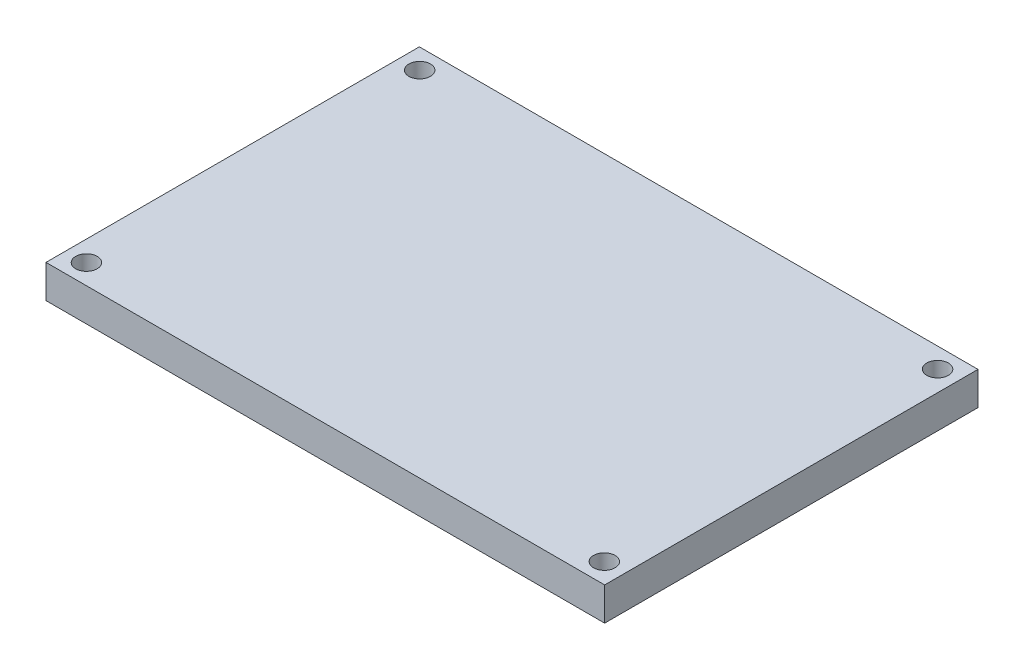
ISO-10303-21;
HEADER;
FILE_DESCRIPTION(('STEP AP214'),'2;1');
FILE_NAME('part.step','',(''),(''),'','','');
FILE_SCHEMA(('AUTOMOTIVE_DESIGN { 1 0 10303 214 1 1 1 1 }'));
ENDSEC;
DATA;
#1=APPLICATION_CONTEXT('core data for automotive mechanical design processes');
#2=APPLICATION_PROTOCOL_DEFINITION('international standard','automotive_design',2000,#1);
#3=PRODUCT_CONTEXT('',#1,'mechanical');
#4=PRODUCT('Part','Part','',(#3));
#5=PRODUCT_RELATED_PRODUCT_CATEGORY('part','',(#4));
#6=PRODUCT_DEFINITION_FORMATION('','',#4);
#7=PRODUCT_DEFINITION_CONTEXT('part definition',#1,'design');
#8=PRODUCT_DEFINITION('design','',#6,#7);
#9=PRODUCT_DEFINITION_SHAPE('','',#8);
#10=(LENGTH_UNIT() NAMED_UNIT(*) SI_UNIT(.MILLI.,.METRE.));
#11=(NAMED_UNIT(*) PLANE_ANGLE_UNIT() SI_UNIT($,.RADIAN.));
#12=(NAMED_UNIT(*) SI_UNIT($,.STERADIAN.) SOLID_ANGLE_UNIT());
#13=UNCERTAINTY_MEASURE_WITH_UNIT(LENGTH_MEASURE(1.E-05),#10,'distance_accuracy_value','');
#14=(GEOMETRIC_REPRESENTATION_CONTEXT(3) GLOBAL_UNCERTAINTY_ASSIGNED_CONTEXT((#13)) GLOBAL_UNIT_ASSIGNED_CONTEXT((#10,
#11,#12)) REPRESENTATION_CONTEXT('',''));
#15=CARTESIAN_POINT('',(0.,0.,0.));
#16=DIRECTION('',(0.,0.,1.));
#17=DIRECTION('',(1.,0.,0.));
#18=AXIS2_PLACEMENT_3D('',#15,#16,#17);
#19=CARTESIAN_POINT('',(0.,5.,0.));
#20=DIRECTION('',(0.,-1.,0.));
#21=DIRECTION('',(0.,0.,-1.));
#22=AXIS2_PLACEMENT_3D('',#19,#20,#21);
#23=PLANE('',#22);
#24=DIRECTION('',(0.,0.,-1.));
#25=VECTOR('',#24,1.);
#26=CARTESIAN_POINT('',(42.16,5.,28.175));
#27=LINE('',#26,#25);
#28=CARTESIAN_POINT('',(42.16,5.,28.175));
#29=VERTEX_POINT('',#28);
#30=CARTESIAN_POINT('',(42.16,5.,-28.175));
#31=VERTEX_POINT('',#30);
#32=EDGE_CURVE('E91',#29,#31,#27,.T.);
#33=ORIENTED_EDGE('',*,*,#32,.T.);
#34=DIRECTION('',(-1.,0.,0.));
#35=VECTOR('',#34,1.);
#36=CARTESIAN_POINT('',(-42.16,5.,-28.175));
#37=LINE('',#36,#35);
#38=CARTESIAN_POINT('',(-42.16,5.,-28.175));
#39=VERTEX_POINT('',#38);
#40=EDGE_CURVE('E86',#31,#39,#37,.T.);
#41=ORIENTED_EDGE('',*,*,#40,.T.);
#42=DIRECTION('',(0.,0.,1.));
#43=VECTOR('',#42,1.);
#44=CARTESIAN_POINT('',(-42.16,5.,28.175));
#45=LINE('',#44,#43);
#46=CARTESIAN_POINT('',(-42.16,5.,28.175));
#47=VERTEX_POINT('',#46);
#48=EDGE_CURVE('E89',#39,#47,#45,.T.);
#49=ORIENTED_EDGE('',*,*,#48,.T.);
#50=DIRECTION('',(1.,0.,0.));
#51=VECTOR('',#50,1.);
#52=CARTESIAN_POINT('',(-42.16,5.,28.175));
#53=LINE('',#52,#51);
#54=EDGE_CURVE('E56',#47,#29,#53,.T.);
#55=ORIENTED_EDGE('',*,*,#54,.T.);
#56=EDGE_LOOP('',(#33,#41,#49,#55));
#57=FACE_BOUND('',#56,.T.);
#58=CARTESIAN_POINT('',(39.085,5.,-25.15));
#59=DIRECTION('',(0.,1.,0.));
#60=DIRECTION('',(0.,0.,1.));
#61=AXIS2_PLACEMENT_3D('',#58,#59,#60);
#62=CIRCLE('',#61,1.625);
#63=CARTESIAN_POINT('',(39.085,5.,-23.525));
#64=VERTEX_POINT('',#63);
#65=EDGE_CURVE('E106',#64,#64,#62,.T.);
#66=ORIENTED_EDGE('',*,*,#65,.F.);
#67=EDGE_LOOP('',(#66));
#68=FACE_BOUND('',#67,.T.);
#69=CARTESIAN_POINT('',(-39.085,5.,-25.15));
#70=DIRECTION('',(0.,1.,0.));
#71=DIRECTION('',(0.,0.,-1.));
#72=AXIS2_PLACEMENT_3D('',#69,#70,#71);
#73=CIRCLE('',#72,1.62500000000002);
#74=CARTESIAN_POINT('',(-39.085,5.,-26.775));
#75=VERTEX_POINT('',#74);
#76=EDGE_CURVE('E121',#75,#75,#73,.T.);
#77=ORIENTED_EDGE('',*,*,#76,.F.);
#78=EDGE_LOOP('',(#77));
#79=FACE_BOUND('',#78,.T.);
#80=CARTESIAN_POINT('',(-39.085,5.,25.15));
#81=DIRECTION('',(0.,1.,0.));
#82=DIRECTION('',(0.,0.,1.));
#83=AXIS2_PLACEMENT_3D('',#80,#81,#82);
#84=CIRCLE('',#83,1.62500000000002);
#85=CARTESIAN_POINT('',(-39.085,5.,26.775));
#86=VERTEX_POINT('',#85);
#87=EDGE_CURVE('E127',#86,#86,#84,.T.);
#88=ORIENTED_EDGE('',*,*,#87,.F.);
#89=EDGE_LOOP('',(#88));
#90=FACE_BOUND('',#89,.T.);
#91=CARTESIAN_POINT('',(39.085,5.,25.15));
#92=DIRECTION('',(0.,1.,0.));
#93=DIRECTION('',(0.,0.,-1.));
#94=AXIS2_PLACEMENT_3D('',#91,#92,#93);
#95=CIRCLE('',#94,1.625);
#96=CARTESIAN_POINT('',(39.085,5.,23.525));
#97=VERTEX_POINT('',#96);
#98=EDGE_CURVE('E133',#97,#97,#95,.T.);
#99=ORIENTED_EDGE('',*,*,#98,.F.);
#100=EDGE_LOOP('',(#99));
#101=FACE_BOUND('',#100,.T.);
#102=ADVANCED_FACE('F39',(#57,#68,#79,#90,#101),#23,.F.);
#103=CARTESIAN_POINT('',(0.,0.,0.));
#104=DIRECTION('',(0.,-1.,0.));
#105=DIRECTION('',(0.,0.,-1.));
#106=AXIS2_PLACEMENT_3D('',#103,#104,#105);
#107=PLANE('',#106);
#108=CARTESIAN_POINT('',(-39.085,0.,25.15));
#109=DIRECTION('',(0.,1.,0.));
#110=DIRECTION('',(0.,0.,1.));
#111=AXIS2_PLACEMENT_3D('',#108,#109,#110);
#112=CIRCLE('',#111,1.62500000000002);
#113=CARTESIAN_POINT('',(-39.085,0.,26.775));
#114=VERTEX_POINT('',#113);
#115=EDGE_CURVE('E130',#114,#114,#112,.T.);
#116=ORIENTED_EDGE('',*,*,#115,.T.);
#117=EDGE_LOOP('',(#116));
#118=FACE_BOUND('',#117,.T.);
#119=CARTESIAN_POINT('',(39.085,0.,-25.15));
#120=DIRECTION('',(0.,1.,0.));
#121=DIRECTION('',(0.,0.,1.));
#122=AXIS2_PLACEMENT_3D('',#119,#120,#121);
#123=CIRCLE('',#122,1.625);
#124=CARTESIAN_POINT('',(39.085,0.,-23.525));
#125=VERTEX_POINT('',#124);
#126=EDGE_CURVE('E118',#125,#125,#123,.T.);
#127=ORIENTED_EDGE('',*,*,#126,.T.);
#128=EDGE_LOOP('',(#127));
#129=FACE_BOUND('',#128,.T.);
#130=DIRECTION('',(0.,0.,-1.));
#131=VECTOR('',#130,1.);
#132=CARTESIAN_POINT('',(42.16,0.,28.175));
#133=LINE('',#132,#131);
#134=CARTESIAN_POINT('',(42.16,0.,28.175));
#135=VERTEX_POINT('',#134);
#136=CARTESIAN_POINT('',(42.16,0.,-28.175));
#137=VERTEX_POINT('',#136);
#138=EDGE_CURVE('E103',#135,#137,#133,.T.);
#139=ORIENTED_EDGE('',*,*,#138,.F.);
#140=DIRECTION('',(1.,0.,0.));
#141=VECTOR('',#140,1.);
#142=CARTESIAN_POINT('',(-42.16,0.,28.175));
#143=LINE('',#142,#141);
#144=CARTESIAN_POINT('',(-42.16,0.,28.175));
#145=VERTEX_POINT('',#144);
#146=EDGE_CURVE('E79',#145,#135,#143,.T.);
#147=ORIENTED_EDGE('',*,*,#146,.F.);
#148=DIRECTION('',(0.,0.,1.));
#149=VECTOR('',#148,1.);
#150=CARTESIAN_POINT('',(-42.16,0.,28.175));
#151=LINE('',#150,#149);
#152=CARTESIAN_POINT('',(-42.16,0.,-28.175));
#153=VERTEX_POINT('',#152);
#154=EDGE_CURVE('E73',#153,#145,#151,.T.);
#155=ORIENTED_EDGE('',*,*,#154,.F.);
#156=DIRECTION('',(-1.,0.,0.));
#157=VECTOR('',#156,1.);
#158=CARTESIAN_POINT('',(-42.16,0.,-28.175));
#159=LINE('',#158,#157);
#160=EDGE_CURVE('E95',#137,#153,#159,.T.);
#161=ORIENTED_EDGE('',*,*,#160,.F.);
#162=EDGE_LOOP('',(#139,#147,#155,#161));
#163=FACE_BOUND('',#162,.T.);
#164=CARTESIAN_POINT('',(-39.085,0.,-25.15));
#165=DIRECTION('',(0.,1.,0.));
#166=DIRECTION('',(0.,0.,-1.));
#167=AXIS2_PLACEMENT_3D('',#164,#165,#166);
#168=CIRCLE('',#167,1.62500000000002);
#169=CARTESIAN_POINT('',(-39.085,0.,-26.775));
#170=VERTEX_POINT('',#169);
#171=EDGE_CURVE('E124',#170,#170,#168,.T.);
#172=ORIENTED_EDGE('',*,*,#171,.T.);
#173=EDGE_LOOP('',(#172));
#174=FACE_BOUND('',#173,.T.);
#175=CARTESIAN_POINT('',(39.085,0.,25.15));
#176=DIRECTION('',(0.,1.,0.));
#177=DIRECTION('',(0.,0.,-1.));
#178=AXIS2_PLACEMENT_3D('',#175,#176,#177);
#179=CIRCLE('',#178,1.625);
#180=CARTESIAN_POINT('',(39.085,0.,23.525));
#181=VERTEX_POINT('',#180);
#182=EDGE_CURVE('E136',#181,#181,#179,.T.);
#183=ORIENTED_EDGE('',*,*,#182,.T.);
#184=EDGE_LOOP('',(#183));
#185=FACE_BOUND('',#184,.T.);
#186=ADVANCED_FACE('F114',(#118,#129,#163,#174,#185),#107,.T.);
#187=CARTESIAN_POINT('',(42.16,5.,28.175));
#188=DIRECTION('',(-1.,0.,0.));
#189=DIRECTION('',(0.,0.,1.));
#190=AXIS2_PLACEMENT_3D('',#187,#188,#189);
#191=PLANE('',#190);
#192=ORIENTED_EDGE('',*,*,#138,.T.);
#193=DIRECTION('',(0.,-1.,0.));
#194=VECTOR('',#193,1.);
#195=CARTESIAN_POINT('',(42.16,5.,-28.175));
#196=LINE('',#195,#194);
#197=EDGE_CURVE('E11',#31,#137,#196,.T.);
#198=ORIENTED_EDGE('',*,*,#197,.F.);
#199=ORIENTED_EDGE('',*,*,#32,.F.);
#200=DIRECTION('',(0.,-1.,0.));
#201=VECTOR('',#200,1.);
#202=CARTESIAN_POINT('',(42.16,5.,28.175));
#203=LINE('',#202,#201);
#204=EDGE_CURVE('E99',#29,#135,#203,.T.);
#205=ORIENTED_EDGE('',*,*,#204,.T.);
#206=EDGE_LOOP('',(#192,#198,#199,#205));
#207=FACE_BOUND('',#206,.T.);
#208=ADVANCED_FACE('F41',(#207),#191,.F.);
#209=CARTESIAN_POINT('',(-42.16,5.,-28.175));
#210=DIRECTION('',(0.,0.,1.));
#211=DIRECTION('',(1.,0.,0.));
#212=AXIS2_PLACEMENT_3D('',#209,#210,#211);
#213=PLANE('',#212);
#214=ORIENTED_EDGE('',*,*,#160,.T.);
#215=DIRECTION('',(0.,-1.,0.));
#216=VECTOR('',#215,1.);
#217=CARTESIAN_POINT('',(-42.16,5.,-28.175));
#218=LINE('',#217,#216);
#219=EDGE_CURVE('E48',#39,#153,#218,.T.);
#220=ORIENTED_EDGE('',*,*,#219,.F.);
#221=ORIENTED_EDGE('',*,*,#40,.F.);
#222=ORIENTED_EDGE('',*,*,#197,.T.);
#223=EDGE_LOOP('',(#214,#220,#221,#222));
#224=FACE_BOUND('',#223,.T.);
#225=ADVANCED_FACE('F94',(#224),#213,.F.);
#226=CARTESIAN_POINT('',(-42.16,5.,28.175));
#227=DIRECTION('',(1.,0.,0.));
#228=DIRECTION('',(0.,0.,-1.));
#229=AXIS2_PLACEMENT_3D('',#226,#227,#228);
#230=PLANE('',#229);
#231=ORIENTED_EDGE('',*,*,#154,.T.);
#232=DIRECTION('',(0.,-1.,0.));
#233=VECTOR('',#232,1.);
#234=CARTESIAN_POINT('',(-42.16,5.,28.175));
#235=LINE('',#234,#233);
#236=EDGE_CURVE('E96',#47,#145,#235,.T.);
#237=ORIENTED_EDGE('',*,*,#236,.F.);
#238=ORIENTED_EDGE('',*,*,#48,.F.);
#239=ORIENTED_EDGE('',*,*,#219,.T.);
#240=EDGE_LOOP('',(#231,#237,#238,#239));
#241=FACE_BOUND('',#240,.T.);
#242=ADVANCED_FACE('F97',(#241),#230,.F.);
#243=CARTESIAN_POINT('',(-42.16,5.,28.175));
#244=DIRECTION('',(0.,0.,-1.));
#245=DIRECTION('',(-1.,0.,0.));
#246=AXIS2_PLACEMENT_3D('',#243,#244,#245);
#247=PLANE('',#246);
#248=ORIENTED_EDGE('',*,*,#146,.T.);
#249=ORIENTED_EDGE('',*,*,#204,.F.);
#250=ORIENTED_EDGE('',*,*,#54,.F.);
#251=ORIENTED_EDGE('',*,*,#236,.T.);
#252=EDGE_LOOP('',(#248,#249,#250,#251));
#253=FACE_BOUND('',#252,.T.);
#254=ADVANCED_FACE('F111',(#253),#247,.F.);
#255=CARTESIAN_POINT('',(39.085,5.,-25.15));
#256=DIRECTION('',(0.,-1.,0.));
#257=DIRECTION('',(0.,0.,-1.));
#258=AXIS2_PLACEMENT_3D('',#255,#256,#257);
#259=CYLINDRICAL_SURFACE('',#258,1.625);
#260=ORIENTED_EDGE('',*,*,#65,.T.);
#261=EDGE_LOOP('',(#260));
#262=FACE_BOUND('',#261,.T.);
#263=ORIENTED_EDGE('',*,*,#126,.F.);
#264=EDGE_LOOP('',(#263));
#265=FACE_BOUND('',#264,.T.);
#266=ADVANCED_FACE('F153',(#262,#265),#259,.F.);
#267=CARTESIAN_POINT('',(-39.085,5.,-25.15));
#268=DIRECTION('',(0.,-1.,0.));
#269=DIRECTION('',(0.,0.,-1.));
#270=AXIS2_PLACEMENT_3D('',#267,#268,#269);
#271=CYLINDRICAL_SURFACE('',#270,1.62500000000002);
#272=ORIENTED_EDGE('',*,*,#76,.T.);
#273=EDGE_LOOP('',(#272));
#274=FACE_BOUND('',#273,.T.);
#275=ORIENTED_EDGE('',*,*,#171,.F.);
#276=EDGE_LOOP('',(#275));
#277=FACE_BOUND('',#276,.T.);
#278=ADVANCED_FACE('F198',(#274,#277),#271,.F.);
#279=CARTESIAN_POINT('',(-39.085,5.,25.15));
#280=DIRECTION('',(0.,-1.,0.));
#281=DIRECTION('',(0.,0.,-1.));
#282=AXIS2_PLACEMENT_3D('',#279,#280,#281);
#283=CYLINDRICAL_SURFACE('',#282,1.62500000000002);
#284=ORIENTED_EDGE('',*,*,#87,.T.);
#285=EDGE_LOOP('',(#284));
#286=FACE_BOUND('',#285,.T.);
#287=ORIENTED_EDGE('',*,*,#115,.F.);
#288=EDGE_LOOP('',(#287));
#289=FACE_BOUND('',#288,.T.);
#290=ADVANCED_FACE('F206',(#286,#289),#283,.F.);
#291=CARTESIAN_POINT('',(39.085,5.,25.15));
#292=DIRECTION('',(0.,-1.,0.));
#293=DIRECTION('',(0.,0.,-1.));
#294=AXIS2_PLACEMENT_3D('',#291,#292,#293);
#295=CYLINDRICAL_SURFACE('',#294,1.625);
#296=ORIENTED_EDGE('',*,*,#98,.T.);
#297=EDGE_LOOP('',(#296));
#298=FACE_BOUND('',#297,.T.);
#299=ORIENTED_EDGE('',*,*,#182,.F.);
#300=EDGE_LOOP('',(#299));
#301=FACE_BOUND('',#300,.T.);
#302=ADVANCED_FACE('F142',(#298,#301),#295,.F.);
#303=CLOSED_SHELL('',(#102,#186,#208,#225,#242,#254,#266,#278,#290,#302));
#304=MANIFOLD_SOLID_BREP('B2',#303);
#305=ADVANCED_BREP_SHAPE_REPRESENTATION('',(#18,#304),#14);
#306=SHAPE_DEFINITION_REPRESENTATION(#9,#305);
ENDSEC;
END-ISO-10303-21;
